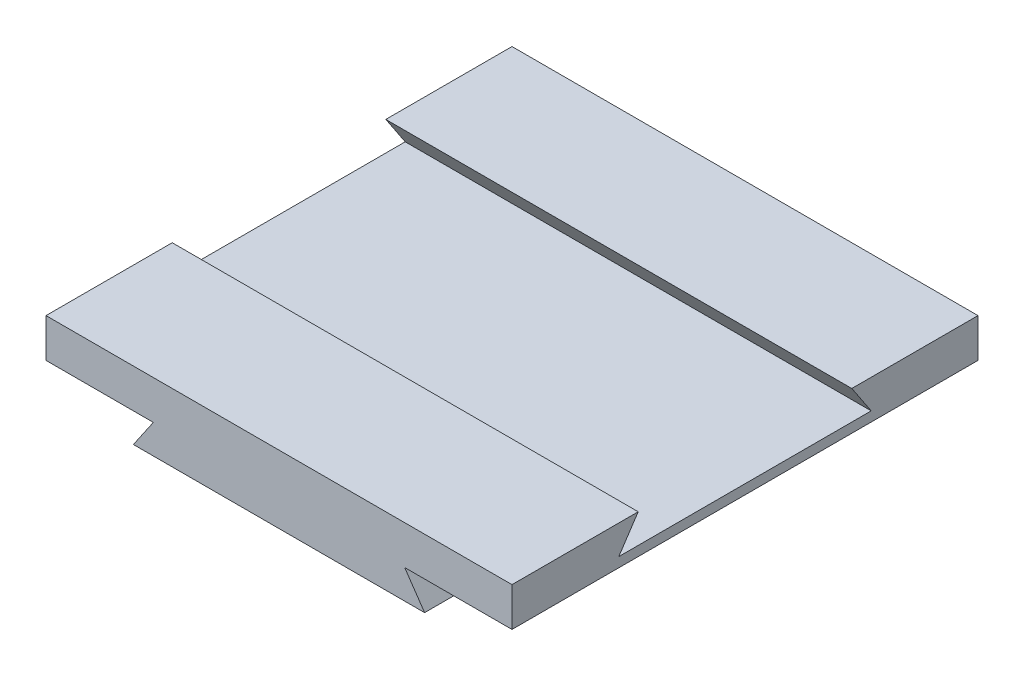
ISO-10303-21;
HEADER;
FILE_DESCRIPTION(('STEP AP214'),'2;1');
FILE_NAME('part.step','',(''),(''),'','','');
FILE_SCHEMA(('AUTOMOTIVE_DESIGN { 1 0 10303 214 1 1 1 1 }'));
ENDSEC;
DATA;
#1=APPLICATION_CONTEXT('core data for automotive mechanical design processes');
#2=APPLICATION_PROTOCOL_DEFINITION('international standard','automotive_design',2000,#1);
#3=PRODUCT_CONTEXT('',#1,'mechanical');
#4=PRODUCT('Part','Part','',(#3));
#5=PRODUCT_RELATED_PRODUCT_CATEGORY('part','',(#4));
#6=PRODUCT_DEFINITION_FORMATION('','',#4);
#7=PRODUCT_DEFINITION_CONTEXT('part definition',#1,'design');
#8=PRODUCT_DEFINITION('design','',#6,#7);
#9=PRODUCT_DEFINITION_SHAPE('','',#8);
#10=(LENGTH_UNIT() NAMED_UNIT(*) SI_UNIT(.MILLI.,.METRE.));
#11=(NAMED_UNIT(*) PLANE_ANGLE_UNIT() SI_UNIT($,.RADIAN.));
#12=(NAMED_UNIT(*) SI_UNIT($,.STERADIAN.) SOLID_ANGLE_UNIT());
#13=UNCERTAINTY_MEASURE_WITH_UNIT(LENGTH_MEASURE(1.E-05),#10,'distance_accuracy_value','');
#14=(GEOMETRIC_REPRESENTATION_CONTEXT(3) GLOBAL_UNCERTAINTY_ASSIGNED_CONTEXT((#13)) GLOBAL_UNIT_ASSIGNED_CONTEXT((#10,
#11,#12)) REPRESENTATION_CONTEXT('',''));
#15=CARTESIAN_POINT('',(0.,0.,0.));
#16=DIRECTION('',(0.,0.,1.));
#17=DIRECTION('',(1.,0.,0.));
#18=AXIS2_PLACEMENT_3D('',#15,#16,#17);
#19=CARTESIAN_POINT('',(-120.,35.,240.));
#20=DIRECTION('',(0.,-1.,0.));
#21=DIRECTION('',(1.,0.,0.));
#22=AXIS2_PLACEMENT_3D('',#19,#20,#21);
#23=PLANE('',#22);
#24=DIRECTION('',(0.,0.,-1.));
#25=VECTOR('',#24,1.);
#26=CARTESIAN_POINT('',(120.,35.,240.));
#27=LINE('',#26,#25);
#28=CARTESIAN_POINT('',(120.,35.,240.));
#29=VERTEX_POINT('',#28);
#30=CARTESIAN_POINT('',(120.,34.9999999999998,175.));
#31=VERTEX_POINT('',#30);
#32=EDGE_CURVE('E166',#29,#31,#27,.T.);
#33=ORIENTED_EDGE('',*,*,#32,.T.);
#34=DIRECTION('',(-1.,0.,0.));
#35=VECTOR('',#34,1.);
#36=CARTESIAN_POINT('',(120.,34.9999999999998,175.));
#37=LINE('',#36,#35);
#38=CARTESIAN_POINT('',(-120.,35.,175.));
#39=VERTEX_POINT('',#38);
#40=EDGE_CURVE('E200',#31,#39,#37,.T.);
#41=ORIENTED_EDGE('',*,*,#40,.T.);
#42=DIRECTION('',(0.,0.,-1.));
#43=VECTOR('',#42,1.);
#44=CARTESIAN_POINT('',(-120.,35.,240.));
#45=LINE('',#44,#43);
#46=CARTESIAN_POINT('',(-120.,35.,240.));
#47=VERTEX_POINT('',#46);
#48=EDGE_CURVE('E163',#47,#39,#45,.T.);
#49=ORIENTED_EDGE('',*,*,#48,.F.);
#50=DIRECTION('',(-1.,0.,0.));
#51=VECTOR('',#50,1.);
#52=CARTESIAN_POINT('',(120.,35.,240.));
#53=LINE('',#52,#51);
#54=EDGE_CURVE('E121',#29,#47,#53,.T.);
#55=ORIENTED_EDGE('',*,*,#54,.F.);
#56=EDGE_LOOP('',(#33,#41,#49,#55));
#57=FACE_BOUND('',#56,.T.);
#58=ADVANCED_FACE('F34',(#57),#23,.F.);
#59=CARTESIAN_POINT('',(0.,0.,240.));
#60=DIRECTION('',(0.,1.,0.));
#61=DIRECTION('',(-1.,0.,0.));
#62=AXIS2_PLACEMENT_3D('',#59,#60,#61);
#63=PLANE('',#62);
#64=DIRECTION('',(1.,0.,0.));
#65=VECTOR('',#64,1.);
#66=CARTESIAN_POINT('',(0.,0.,0.));
#67=LINE('',#66,#65);
#68=CARTESIAN_POINT('',(-75.,0.,0.));
#69=VERTEX_POINT('',#68);
#70=CARTESIAN_POINT('',(75.,0.,0.));
#71=VERTEX_POINT('',#70);
#72=EDGE_CURVE('E91',#69,#71,#67,.T.);
#73=ORIENTED_EDGE('',*,*,#72,.T.);
#74=DIRECTION('',(0.,0.,-1.));
#75=VECTOR('',#74,1.);
#76=CARTESIAN_POINT('',(75.,0.,240.));
#77=LINE('',#76,#75);
#78=CARTESIAN_POINT('',(75.,0.,240.));
#79=VERTEX_POINT('',#78);
#80=EDGE_CURVE('E11',#79,#71,#77,.T.);
#81=ORIENTED_EDGE('',*,*,#80,.F.);
#82=DIRECTION('',(1.,0.,0.));
#83=VECTOR('',#82,1.);
#84=CARTESIAN_POINT('',(0.,0.,240.));
#85=LINE('',#84,#83);
#86=CARTESIAN_POINT('',(-75.,0.,240.));
#87=VERTEX_POINT('',#86);
#88=EDGE_CURVE('E97',#87,#79,#85,.T.);
#89=ORIENTED_EDGE('',*,*,#88,.F.);
#90=DIRECTION('',(0.,0.,-1.));
#91=VECTOR('',#90,1.);
#92=CARTESIAN_POINT('',(-75.,0.,240.));
#93=LINE('',#92,#91);
#94=EDGE_CURVE('E139',#87,#69,#93,.T.);
#95=ORIENTED_EDGE('',*,*,#94,.T.);
#96=EDGE_LOOP('',(#73,#81,#89,#95));
#97=FACE_BOUND('',#96,.T.);
#98=ADVANCED_FACE('F36',(#97),#63,.F.);
#99=CARTESIAN_POINT('',(75.,0.,240.));
#100=DIRECTION('',(-0.824875387239033,-0.56531459872115,0.));
#101=DIRECTION('',(0.56531459872115,-0.824875387239033,0.));
#102=AXIS2_PLACEMENT_3D('',#99,#100,#101);
#103=PLANE('',#102);
#104=DIRECTION('',(-0.56531459872115,0.824875387239033,0.));
#105=VECTOR('',#104,1.);
#106=CARTESIAN_POINT('',(75.,0.,0.));
#107=LINE('',#106,#105);
#108=CARTESIAN_POINT('',(64.72,15.,0.));
#109=VERTEX_POINT('',#108);
#110=EDGE_CURVE('E144',#71,#109,#107,.T.);
#111=ORIENTED_EDGE('',*,*,#110,.T.);
#112=DIRECTION('',(0.,0.,-1.));
#113=VECTOR('',#112,1.);
#114=CARTESIAN_POINT('',(64.72,15.,240.));
#115=LINE('',#114,#113);
#116=CARTESIAN_POINT('',(64.72,15.,240.));
#117=VERTEX_POINT('',#116);
#118=EDGE_CURVE('E42',#117,#109,#115,.T.);
#119=ORIENTED_EDGE('',*,*,#118,.F.);
#120=DIRECTION('',(-0.56531459872115,0.824875387239033,0.));
#121=VECTOR('',#120,1.);
#122=CARTESIAN_POINT('',(75.,0.,240.));
#123=LINE('',#122,#121);
#124=EDGE_CURVE('E195',#79,#117,#123,.T.);
#125=ORIENTED_EDGE('',*,*,#124,.F.);
#126=ORIENTED_EDGE('',*,*,#80,.T.);
#127=EDGE_LOOP('',(#111,#119,#125,#126));
#128=FACE_BOUND('',#127,.T.);
#129=ADVANCED_FACE('F262',(#128),#103,.F.);
#130=CARTESIAN_POINT('',(64.72,15.,240.));
#131=DIRECTION('',(0.,1.,0.));
#132=DIRECTION('',(-1.,0.,0.));
#133=AXIS2_PLACEMENT_3D('',#130,#131,#132);
#134=PLANE('',#133);
#135=DIRECTION('',(1.,0.,0.));
#136=VECTOR('',#135,1.);
#137=CARTESIAN_POINT('',(64.72,15.,0.));
#138=LINE('',#137,#136);
#139=CARTESIAN_POINT('',(120.,15.,0.));
#140=VERTEX_POINT('',#139);
#141=EDGE_CURVE('E147',#109,#140,#138,.T.);
#142=ORIENTED_EDGE('',*,*,#141,.T.);
#143=DIRECTION('',(0.,0.,-1.));
#144=VECTOR('',#143,1.);
#145=CARTESIAN_POINT('',(120.,15.,240.));
#146=LINE('',#145,#144);
#147=CARTESIAN_POINT('',(120.,15.,240.));
#148=VERTEX_POINT('',#147);
#149=EDGE_CURVE('E169',#148,#140,#146,.T.);
#150=ORIENTED_EDGE('',*,*,#149,.F.);
#151=DIRECTION('',(1.,0.,0.));
#152=VECTOR('',#151,1.);
#153=CARTESIAN_POINT('',(64.72,15.,240.));
#154=LINE('',#153,#152);
#155=EDGE_CURVE('E178',#117,#148,#154,.T.);
#156=ORIENTED_EDGE('',*,*,#155,.F.);
#157=ORIENTED_EDGE('',*,*,#118,.T.);
#158=EDGE_LOOP('',(#142,#150,#156,#157));
#159=FACE_BOUND('',#158,.T.);
#160=ADVANCED_FACE('F176',(#159),#134,.F.);
#161=CARTESIAN_POINT('',(120.,15.,240.));
#162=DIRECTION('',(-1.,0.,0.));
#163=DIRECTION('',(0.,-1.,0.));
#164=AXIS2_PLACEMENT_3D('',#161,#162,#163);
#165=PLANE('',#164);
#166=DIRECTION('',(0.,0.,1.));
#167=VECTOR('',#166,1.);
#168=CARTESIAN_POINT('',(120.,19.9999999999998,185.));
#169=LINE('',#168,#167);
#170=CARTESIAN_POINT('',(120.,19.9999999999998,55.));
#171=VERTEX_POINT('',#170);
#172=CARTESIAN_POINT('',(120.,19.9999999999998,185.));
#173=VERTEX_POINT('',#172);
#174=EDGE_CURVE('E203',#171,#173,#169,.T.);
#175=ORIENTED_EDGE('',*,*,#174,.T.);
#176=DIRECTION('',(0.,0.832050294337843,-0.55470019622523));
#177=VECTOR('',#176,1.);
#178=CARTESIAN_POINT('',(120.,34.9999999999998,175.));
#179=LINE('',#178,#177);
#180=EDGE_CURVE('E213',#173,#31,#179,.T.);
#181=ORIENTED_EDGE('',*,*,#180,.T.);
#182=ORIENTED_EDGE('',*,*,#32,.F.);
#183=DIRECTION('',(0.,1.,0.));
#184=VECTOR('',#183,1.);
#185=CARTESIAN_POINT('',(120.,15.,240.));
#186=LINE('',#185,#184);
#187=EDGE_CURVE('E192',#148,#29,#186,.T.);
#188=ORIENTED_EDGE('',*,*,#187,.F.);
#189=ORIENTED_EDGE('',*,*,#149,.T.);
#190=DIRECTION('',(0.,1.,0.));
#191=VECTOR('',#190,1.);
#192=CARTESIAN_POINT('',(120.,15.,0.));
#193=LINE('',#192,#191);
#194=CARTESIAN_POINT('',(120.,35.,0.));
#195=VERTEX_POINT('',#194);
#196=EDGE_CURVE('E149',#140,#195,#193,.T.);
#197=ORIENTED_EDGE('',*,*,#196,.T.);
#198=CARTESIAN_POINT('',(120.,34.9999999999998,65.));
#199=VERTEX_POINT('',#198);
#200=EDGE_CURVE('E165',#199,#195,#27,.T.);
#201=ORIENTED_EDGE('',*,*,#200,.F.);
#202=DIRECTION('',(0.,-0.832050294337843,-0.55470019622523));
#203=VECTOR('',#202,1.);
#204=CARTESIAN_POINT('',(120.,34.9999999999998,65.));
#205=LINE('',#204,#203);
#206=EDGE_CURVE('E220',#199,#171,#205,.T.);
#207=ORIENTED_EDGE('',*,*,#206,.T.);
#208=EDGE_LOOP('',(#175,#181,#182,#188,#189,#197,#201,#207));
#209=FACE_BOUND('',#208,.T.);
#210=ADVANCED_FACE('F187',(#209),#165,.F.);
#211=CARTESIAN_POINT('',(-120.,35.,65.));
#212=VERTEX_POINT('',#211);
#213=CARTESIAN_POINT('',(-120.,35.,0.));
#214=VERTEX_POINT('',#213);
#215=EDGE_CURVE('E133',#212,#214,#45,.T.);
#216=ORIENTED_EDGE('',*,*,#215,.F.);
#217=DIRECTION('',(-1.,0.,0.));
#218=VECTOR('',#217,1.);
#219=CARTESIAN_POINT('',(120.,34.9999999999998,65.));
#220=LINE('',#219,#218);
#221=EDGE_CURVE('E49',#199,#212,#220,.T.);
#222=ORIENTED_EDGE('',*,*,#221,.F.);
#223=ORIENTED_EDGE('',*,*,#200,.T.);
#224=DIRECTION('',(-1.,0.,0.));
#225=VECTOR('',#224,1.);
#226=CARTESIAN_POINT('',(-120.,35.,0.));
#227=LINE('',#226,#225);
#228=EDGE_CURVE('E152',#195,#214,#227,.T.);
#229=ORIENTED_EDGE('',*,*,#228,.T.);
#230=EDGE_LOOP('',(#216,#222,#223,#229));
#231=FACE_BOUND('',#230,.T.);
#232=ADVANCED_FACE('F243',(#231),#23,.F.);
#233=CARTESIAN_POINT('',(-120.,15.,240.));
#234=DIRECTION('',(1.,0.,0.));
#235=DIRECTION('',(0.,1.,0.));
#236=AXIS2_PLACEMENT_3D('',#233,#234,#235);
#237=PLANE('',#236);
#238=ORIENTED_EDGE('',*,*,#48,.T.);
#239=DIRECTION('',(0.,0.832050294337843,-0.55470019622523));
#240=VECTOR('',#239,1.);
#241=CARTESIAN_POINT('',(-120.,35.,175.));
#242=LINE('',#241,#240);
#243=CARTESIAN_POINT('',(-120.,20.,185.));
#244=VERTEX_POINT('',#243);
#245=EDGE_CURVE('E216',#244,#39,#242,.T.);
#246=ORIENTED_EDGE('',*,*,#245,.F.);
#247=DIRECTION('',(0.,0.,1.));
#248=VECTOR('',#247,1.);
#249=CARTESIAN_POINT('',(-120.,20.,185.));
#250=LINE('',#249,#248);
#251=CARTESIAN_POINT('',(-120.,20.,55.));
#252=VERTEX_POINT('',#251);
#253=EDGE_CURVE('E210',#252,#244,#250,.T.);
#254=ORIENTED_EDGE('',*,*,#253,.F.);
#255=DIRECTION('',(0.,-0.832050294337843,-0.55470019622523));
#256=VECTOR('',#255,1.);
#257=CARTESIAN_POINT('',(-120.,35.,65.));
#258=LINE('',#257,#256);
#259=EDGE_CURVE('E214',#212,#252,#258,.T.);
#260=ORIENTED_EDGE('',*,*,#259,.F.);
#261=ORIENTED_EDGE('',*,*,#215,.T.);
#262=DIRECTION('',(0.,-1.,0.));
#263=VECTOR('',#262,1.);
#264=CARTESIAN_POINT('',(-120.,15.,0.));
#265=LINE('',#264,#263);
#266=CARTESIAN_POINT('',(-120.,15.,0.));
#267=VERTEX_POINT('',#266);
#268=EDGE_CURVE('E130',#214,#267,#265,.T.);
#269=ORIENTED_EDGE('',*,*,#268,.T.);
#270=DIRECTION('',(0.,0.,-1.));
#271=VECTOR('',#270,1.);
#272=CARTESIAN_POINT('',(-120.,15.,240.));
#273=LINE('',#272,#271);
#274=CARTESIAN_POINT('',(-120.,15.,240.));
#275=VERTEX_POINT('',#274);
#276=EDGE_CURVE('E127',#275,#267,#273,.T.);
#277=ORIENTED_EDGE('',*,*,#276,.F.);
#278=DIRECTION('',(0.,-1.,0.));
#279=VECTOR('',#278,1.);
#280=CARTESIAN_POINT('',(-120.,15.,240.));
#281=LINE('',#280,#279);
#282=EDGE_CURVE('E114',#47,#275,#281,.T.);
#283=ORIENTED_EDGE('',*,*,#282,.F.);
#284=EDGE_LOOP('',(#238,#246,#254,#260,#261,#269,#277,#283));
#285=FACE_BOUND('',#284,.T.);
#286=ADVANCED_FACE('F128',(#285),#237,.F.);
#287=CARTESIAN_POINT('',(-64.72,15.,240.));
#288=DIRECTION('',(0.,1.,0.));
#289=DIRECTION('',(-1.,0.,0.));
#290=AXIS2_PLACEMENT_3D('',#287,#288,#289);
#291=PLANE('',#290);
#292=DIRECTION('',(1.,0.,0.));
#293=VECTOR('',#292,1.);
#294=CARTESIAN_POINT('',(-64.72,15.,0.));
#295=LINE('',#294,#293);
#296=CARTESIAN_POINT('',(-64.72,15.,0.));
#297=VERTEX_POINT('',#296);
#298=EDGE_CURVE('E156',#267,#297,#295,.T.);
#299=ORIENTED_EDGE('',*,*,#298,.T.);
#300=DIRECTION('',(0.,0.,-1.));
#301=VECTOR('',#300,1.);
#302=CARTESIAN_POINT('',(-64.72,15.,240.));
#303=LINE('',#302,#301);
#304=CARTESIAN_POINT('',(-64.72,15.,240.));
#305=VERTEX_POINT('',#304);
#306=EDGE_CURVE('E134',#305,#297,#303,.T.);
#307=ORIENTED_EDGE('',*,*,#306,.F.);
#308=DIRECTION('',(1.,0.,0.));
#309=VECTOR('',#308,1.);
#310=CARTESIAN_POINT('',(-64.72,15.,240.));
#311=LINE('',#310,#309);
#312=EDGE_CURVE('E118',#275,#305,#311,.T.);
#313=ORIENTED_EDGE('',*,*,#312,.F.);
#314=ORIENTED_EDGE('',*,*,#276,.T.);
#315=EDGE_LOOP('',(#299,#307,#313,#314));
#316=FACE_BOUND('',#315,.T.);
#317=ADVANCED_FACE('F136',(#316),#291,.F.);
#318=CARTESIAN_POINT('',(-75.,0.,240.));
#319=DIRECTION('',(0.824875387239033,-0.56531459872115,0.));
#320=DIRECTION('',(0.56531459872115,0.824875387239033,0.));
#321=AXIS2_PLACEMENT_3D('',#318,#319,#320);
#322=PLANE('',#321);
#323=DIRECTION('',(-0.56531459872115,-0.824875387239033,0.));
#324=VECTOR('',#323,1.);
#325=CARTESIAN_POINT('',(-75.,0.,0.));
#326=LINE('',#325,#324);
#327=EDGE_CURVE('E158',#297,#69,#326,.T.);
#328=ORIENTED_EDGE('',*,*,#327,.T.);
#329=ORIENTED_EDGE('',*,*,#94,.F.);
#330=DIRECTION('',(-0.56531459872115,-0.824875387239033,0.));
#331=VECTOR('',#330,1.);
#332=CARTESIAN_POINT('',(-75.,0.,240.));
#333=LINE('',#332,#331);
#334=EDGE_CURVE('E58',#305,#87,#333,.T.);
#335=ORIENTED_EDGE('',*,*,#334,.F.);
#336=ORIENTED_EDGE('',*,*,#306,.T.);
#337=EDGE_LOOP('',(#328,#329,#335,#336));
#338=FACE_BOUND('',#337,.T.);
#339=ADVANCED_FACE('F279',(#338),#322,.F.);
#340=CARTESIAN_POINT('',(0.,0.,240.));
#341=DIRECTION('',(0.,0.,-1.));
#342=DIRECTION('',(-1.,0.,0.));
#343=AXIS2_PLACEMENT_3D('',#340,#341,#342);
#344=PLANE('',#343);
#345=ORIENTED_EDGE('',*,*,#88,.T.);
#346=ORIENTED_EDGE('',*,*,#124,.T.);
#347=ORIENTED_EDGE('',*,*,#155,.T.);
#348=ORIENTED_EDGE('',*,*,#187,.T.);
#349=ORIENTED_EDGE('',*,*,#54,.T.);
#350=ORIENTED_EDGE('',*,*,#282,.T.);
#351=ORIENTED_EDGE('',*,*,#312,.T.);
#352=ORIENTED_EDGE('',*,*,#334,.T.);
#353=EDGE_LOOP('',(#345,#346,#347,#348,#349,#350,#351,#352));
#354=FACE_BOUND('',#353,.T.);
#355=ADVANCED_FACE('F116',(#354),#344,.F.);
#356=CARTESIAN_POINT('',(0.,0.,0.));
#357=DIRECTION('',(0.,0.,-1.));
#358=DIRECTION('',(-1.,0.,0.));
#359=AXIS2_PLACEMENT_3D('',#356,#357,#358);
#360=PLANE('',#359);
#361=ORIENTED_EDGE('',*,*,#72,.F.);
#362=ORIENTED_EDGE('',*,*,#327,.F.);
#363=ORIENTED_EDGE('',*,*,#298,.F.);
#364=ORIENTED_EDGE('',*,*,#268,.F.);
#365=ORIENTED_EDGE('',*,*,#228,.F.);
#366=ORIENTED_EDGE('',*,*,#196,.F.);
#367=ORIENTED_EDGE('',*,*,#141,.F.);
#368=ORIENTED_EDGE('',*,*,#110,.F.);
#369=EDGE_LOOP('',(#361,#362,#363,#364,#365,#366,#367,#368));
#370=FACE_BOUND('',#369,.T.);
#371=ADVANCED_FACE('F182',(#370),#360,.T.);
#372=CARTESIAN_POINT('',(120.,34.9999999999998,175.));
#373=DIRECTION('',(0.,0.55470019622523,0.832050294337843));
#374=DIRECTION('',(0.,-0.832050294337843,0.55470019622523));
#375=AXIS2_PLACEMENT_3D('',#372,#373,#374);
#376=PLANE('',#375);
#377=ORIENTED_EDGE('',*,*,#245,.T.);
#378=ORIENTED_EDGE('',*,*,#40,.F.);
#379=ORIENTED_EDGE('',*,*,#180,.F.);
#380=DIRECTION('',(-1.,0.,0.));
#381=VECTOR('',#380,1.);
#382=CARTESIAN_POINT('',(120.,19.9999999999998,185.));
#383=LINE('',#382,#381);
#384=EDGE_CURVE('E145',#173,#244,#383,.T.);
#385=ORIENTED_EDGE('',*,*,#384,.T.);
#386=EDGE_LOOP('',(#377,#378,#379,#385));
#387=FACE_BOUND('',#386,.T.);
#388=ADVANCED_FACE('F246',(#387),#376,.F.);
#389=CARTESIAN_POINT('',(120.,19.9999999999998,185.));
#390=DIRECTION('',(0.,-1.,0.));
#391=DIRECTION('',(1.,0.,0.));
#392=AXIS2_PLACEMENT_3D('',#389,#390,#391);
#393=PLANE('',#392);
#394=ORIENTED_EDGE('',*,*,#253,.T.);
#395=ORIENTED_EDGE('',*,*,#384,.F.);
#396=ORIENTED_EDGE('',*,*,#174,.F.);
#397=DIRECTION('',(-1.,0.,0.));
#398=VECTOR('',#397,1.);
#399=CARTESIAN_POINT('',(120.,19.9999999999998,55.));
#400=LINE('',#399,#398);
#401=EDGE_CURVE('E205',#171,#252,#400,.T.);
#402=ORIENTED_EDGE('',*,*,#401,.T.);
#403=EDGE_LOOP('',(#394,#395,#396,#402));
#404=FACE_BOUND('',#403,.T.);
#405=ADVANCED_FACE('F245',(#404),#393,.F.);
#406=CARTESIAN_POINT('',(120.,34.9999999999998,65.));
#407=DIRECTION('',(0.,0.55470019622523,-0.832050294337843));
#408=DIRECTION('',(0.,0.832050294337843,0.55470019622523));
#409=AXIS2_PLACEMENT_3D('',#406,#407,#408);
#410=PLANE('',#409);
#411=ORIENTED_EDGE('',*,*,#259,.T.);
#412=ORIENTED_EDGE('',*,*,#401,.F.);
#413=ORIENTED_EDGE('',*,*,#206,.F.);
#414=ORIENTED_EDGE('',*,*,#221,.T.);
#415=EDGE_LOOP('',(#411,#412,#413,#414));
#416=FACE_BOUND('',#415,.T.);
#417=ADVANCED_FACE('F240',(#416),#410,.F.);
#418=CLOSED_SHELL('',(#58,#98,#129,#160,#210,#232,#286,#317,#339,#355,#371,#388,#405,#417));
#419=MANIFOLD_SOLID_BREP('B2',#418);
#420=ADVANCED_BREP_SHAPE_REPRESENTATION('',(#18,#419),#14);
#421=SHAPE_DEFINITION_REPRESENTATION(#9,#420);
ENDSEC;
END-ISO-10303-21;
